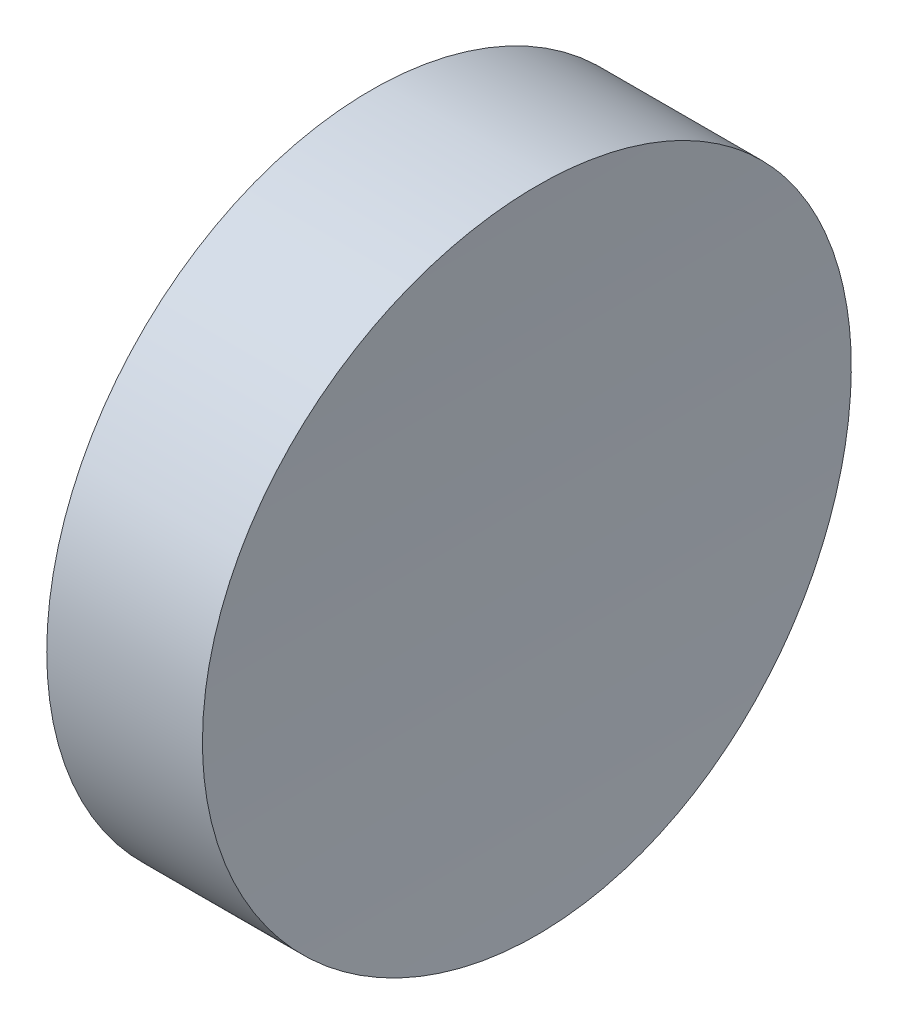
ISO-10303-21;
HEADER;
FILE_DESCRIPTION(('STEP AP214'),'2;1');
FILE_NAME('part.step','',(''),(''),'','','');
FILE_SCHEMA(('AUTOMOTIVE_DESIGN { 1 0 10303 214 1 1 1 1 }'));
ENDSEC;
DATA;
#1=APPLICATION_CONTEXT('core data for automotive mechanical design processes');
#2=APPLICATION_PROTOCOL_DEFINITION('international standard','automotive_design',2000,#1);
#3=PRODUCT_CONTEXT('',#1,'mechanical');
#4=PRODUCT('Part','Part','',(#3));
#5=PRODUCT_RELATED_PRODUCT_CATEGORY('part','',(#4));
#6=PRODUCT_DEFINITION_FORMATION('','',#4);
#7=PRODUCT_DEFINITION_CONTEXT('part definition',#1,'design');
#8=PRODUCT_DEFINITION('design','',#6,#7);
#9=PRODUCT_DEFINITION_SHAPE('','',#8);
#10=(LENGTH_UNIT() NAMED_UNIT(*) SI_UNIT(.MILLI.,.METRE.));
#11=(NAMED_UNIT(*) PLANE_ANGLE_UNIT() SI_UNIT($,.RADIAN.));
#12=(NAMED_UNIT(*) SI_UNIT($,.STERADIAN.) SOLID_ANGLE_UNIT());
#13=UNCERTAINTY_MEASURE_WITH_UNIT(LENGTH_MEASURE(1.E-05),#10,'distance_accuracy_value','');
#14=(GEOMETRIC_REPRESENTATION_CONTEXT(3) GLOBAL_UNCERTAINTY_ASSIGNED_CONTEXT((#13)) GLOBAL_UNIT_ASSIGNED_CONTEXT((#10,
#11,#12)) REPRESENTATION_CONTEXT('',''));
#15=CARTESIAN_POINT('',(0.,0.,0.));
#16=DIRECTION('',(0.,0.,1.));
#17=DIRECTION('',(1.,0.,0.));
#18=AXIS2_PLACEMENT_3D('',#15,#16,#17);
#19=CARTESIAN_POINT('',(10.,0.,0.));
#20=DIRECTION('',(-1.,0.,0.));
#21=DIRECTION('',(0.,0.,1.));
#22=AXIS2_PLACEMENT_3D('',#19,#20,#21);
#23=CYLINDRICAL_SURFACE('',#22,6.25);
#24=CARTESIAN_POINT('',(3.,0.,6.25));
#25=CARTESIAN_POINT('',(2.99999975282153,0.175411695775562,6.25000143414687));
#26=CARTESIAN_POINT('',(3.00046249596297,0.350800526930083,6.24261243693982));
#27=CARTESIAN_POINT('',(3.00230001398185,0.700387534380133,6.21310928672729));
#28=CARTESIAN_POINT('',(3.0036750205354,0.874585396863903,6.19099139320326));
#29=CARTESIAN_POINT('',(3.00730019714173,1.22063933643133,6.13215890796169));
#30=CARTESIAN_POINT('',(3.00955111473763,1.39249328308806,6.09543184750703));
#31=CARTESIAN_POINT('',(3.01486512988574,1.73255098872519,6.00762967850853));
#32=CARTESIAN_POINT('',(3.01792852436811,1.90075338883798,5.95654932396142));
#33=CARTESIAN_POINT('',(3.02477717765007,2.2320975697538,5.84046483123771));
#34=CARTESIAN_POINT('',(3.02856178668783,2.39524375318645,5.77547321964586));
#35=CARTESIAN_POINT('',(3.03674908130322,2.7155371747568,5.63197690343857));
#36=CARTESIAN_POINT('',(3.0411519942849,2.87268217857003,5.55346722464284));
#37=CARTESIAN_POINT('',(3.05044747258813,3.17970547389867,5.38356179219484));
#38=CARTESIAN_POINT('',(3.05533974263971,3.32958806734663,5.2921737956587));
#39=CARTESIAN_POINT('',(3.06547981948221,3.62118365163041,5.09708857059595));
#40=CARTESIAN_POINT('',(3.07072775701874,3.76289360232956,4.99338680479954));
#41=CARTESIAN_POINT('',(3.08143434461132,4.03721456181779,4.77433107889722));
#42=CARTESIAN_POINT('',(3.08689319052866,4.169816779086,4.65896611879228));
#43=CARTESIAN_POINT('',(3.09786434474732,4.42488384228219,4.41743852364674));
#44=CARTESIAN_POINT('',(3.10337667205306,4.54734492530576,4.29127191561924));
#45=CARTESIAN_POINT('',(3.11429475015486,4.78116986424197,4.0291134014546));
#46=CARTESIAN_POINT('',(3.11970053520273,4.89253733486064,3.89312472078814));
#47=CARTESIAN_POINT('',(3.13025608796702,5.10347041631023,3.6121953285557));
#48=CARTESIAN_POINT('',(3.13540576044397,5.20303165558178,3.46725133108256));
#49=CARTESIAN_POINT('',(3.14530285952053,5.38963801087312,3.16941570454395));
#50=CARTESIAN_POINT('',(3.15005010835547,5.47667760735553,3.0165206108207));
#51=CARTESIAN_POINT('',(3.15900645103708,5.6375973489524,2.70387205086162));
#52=CARTESIAN_POINT('',(3.16321534529791,5.71147261758289,2.54411607021835));
#53=CARTESIAN_POINT('',(3.17097117607028,5.84547023298534,2.21897871845918));
#54=CARTESIAN_POINT('',(3.17451836222469,5.90559776830976,2.05359949677873));
#55=CARTESIAN_POINT('',(3.18085362762582,6.01172184056731,1.718335468201));
#56=CARTESIAN_POINT('',(3.18364142658918,6.05771316074529,1.54844902304539));
#57=CARTESIAN_POINT('',(3.19072745555506,6.1737728734606,1.03440869097554));
#58=CARTESIAN_POINT('',(3.19376771631694,6.22225107187843,0.685085319849295));
#59=CARTESIAN_POINT('',(3.19612000985213,6.2598592561564,-0.016563252411651));
#60=CARTESIAN_POINT('',(3.19543208484992,6.24898991417141,-0.368888419503667));
#61=CARTESIAN_POINT('',(3.19041605812459,6.16835192910068,-1.06624990332797));
#62=CARTESIAN_POINT('',(3.18609307139905,6.09866604790453,-1.41129576399771));
#63=CARTESIAN_POINT('',(3.17430045774624,5.90248091136762,-2.08476940449059));
#64=CARTESIAN_POINT('',(3.16683081196514,5.77598131561582,-2.41319708472936));
#65=CARTESIAN_POINT('',(3.14958122762516,5.46967113790213,-3.04439404545759));
#66=CARTESIAN_POINT('',(3.1397996626731,5.28982300339313,-3.34714505821169));
#67=CARTESIAN_POINT('',(3.11903006741817,4.88194672076172,-3.91819049349543));
#68=CARTESIAN_POINT('',(3.10804202355257,4.65391803098673,-4.18648452860036));
#69=CARTESIAN_POINT('',(3.08607506250479,4.15568767254906,-4.68148297816085));
#70=CARTESIAN_POINT('',(3.07509619328168,3.88541435809242,-4.90811528776023));
#71=CARTESIAN_POINT('',(3.05440293175019,3.31061788534803,-5.31280052009997));
#72=CARTESIAN_POINT('',(3.0446885398836,3.00609471509426,-5.49085342586787));
#73=CARTESIAN_POINT('',(3.02761813096755,2.37139913187018,-5.79331955782815));
#74=CARTESIAN_POINT('',(3.02026223399378,2.04122541404212,-5.91773005308958));
#75=CARTESIAN_POINT('',(3.00873933794533,1.3646206924184,-6.10933161213791));
#76=CARTESIAN_POINT('',(3.00457230162862,1.01818987853609,-6.17652334417176));
#77=CARTESIAN_POINT('',(2.99990148672145,0.319530484202308,-6.25169071012972));
#78=CARTESIAN_POINT('',(2.99939154096187,-0.0326873311797192,-6.25976603604084));
#79=CARTESIAN_POINT('',(3.00207596678201,-0.733472537613214,-6.21673183216969));
#80=CARTESIAN_POINT('',(3.00527031908463,-1.08203994765179,-6.16562261038255));
#81=CARTESIAN_POINT('',(3.01499976696369,-1.76534894498554,-6.00575268445015));
#82=CARTESIAN_POINT('',(3.02153221197085,-2.10010127438763,-5.89703771887342));
#83=CARTESIAN_POINT('',(3.03720291990549,-2.74660925587873,-5.62508869233438));
#84=CARTESIAN_POINT('',(3.04634120627014,-3.05836470110001,-5.4618541410159));
#85=CARTESIAN_POINT('',(3.06621215312903,-3.65048587191085,-5.08524613395083));
#86=CARTESIAN_POINT('',(3.0769469238261,-3.93080917765666,-4.87180609700927));
#87=CARTESIAN_POINT('',(3.09879566670794,-4.45168155224733,-4.40094156283031));
#88=CARTESIAN_POINT('',(3.10990964262544,-4.69223022943292,-4.14351663252608));
#89=CARTESIAN_POINT('',(3.13128210046607,-5.12706324137445,-3.59156423267375));
#90=CARTESIAN_POINT('',(3.14153937360663,-5.32128290068955,-3.2969857629855));
#91=CARTESIAN_POINT('',(3.1600221830158,-5.65750042982147,-2.67932719586049));
#92=CARTESIAN_POINT('',(3.16824773181321,-5.79949862166939,-2.35624727419723));
#93=CARTESIAN_POINT('',(3.18173177695383,-6.02713732282975,-1.69105827249094));
#94=CARTESIAN_POINT('',(3.18699241581342,-6.11281853562915,-1.34896313021398));
#95=CARTESIAN_POINT('',(3.19395554311438,-6.22549830363627,-0.655017303226514));
#96=CARTESIAN_POINT('',(3.19565806687023,-6.25249744126667,-0.303166715374417));
#97=CARTESIAN_POINT('',(3.19540905059048,-6.24847457226867,0.223611624143795));
#98=CARTESIAN_POINT('',(3.1948595343774,-6.23972325454669,0.398982264486074));
#99=CARTESIAN_POINT('',(3.19285036603919,-6.20751102323974,0.74834457396785));
#100=CARTESIAN_POINT('',(3.19139105058246,-6.18405555086406,0.922336729102901));
#101=CARTESIAN_POINT('',(3.18760157602614,-6.12258555837999,1.26777391306693));
#102=CARTESIAN_POINT('',(3.18527109532243,-6.08456566146096,1.43921797689568));
#103=CARTESIAN_POINT('',(3.17980719178045,-5.99426013777771,1.77822935286466));
#104=CARTESIAN_POINT('',(3.17667406438502,-5.94197975963661,1.94579806677502));
#105=CARTESIAN_POINT('',(3.16969209192615,-5.82349910897841,2.27599148238164));
#106=CARTESIAN_POINT('',(3.16584299053225,-5.75729385001185,2.43861438906023));
#107=CARTESIAN_POINT('',(3.15754068209407,-5.61147442351194,2.75764464483826));
#108=CARTESIAN_POINT('',(3.15308769748709,-5.53186519066774,2.91405425527402));
#109=CARTESIAN_POINT('',(3.14370112672049,-5.35975756617542,3.21966840932794));
#110=CARTESIAN_POINT('',(3.13876737785678,-5.26725480640588,3.36887048798478));
#111=CARTESIAN_POINT('',(3.12856215788026,-5.07007314723543,3.65890659889868));
#112=CARTESIAN_POINT('',(3.12329081122199,-4.96539872341104,3.79974367840569));
#113=CARTESIAN_POINT('',(3.11254720796232,-4.74436894280843,4.07238513066016));
#114=CARTESIAN_POINT('',(3.10707457644593,-4.62799100709619,4.20417118475326));
#115=CARTESIAN_POINT('',(3.09609541989795,-4.38459577459138,4.45742679175301));
#116=CARTESIAN_POINT('',(3.09058890805737,-4.25758240235755,4.57890011710425));
#117=CARTESIAN_POINT('',(3.07969257558626,-3.99369614606897,4.81079648756327));
#118=CARTESIAN_POINT('',(3.07430282866911,-3.85681725701957,4.92121270299899));
#119=CARTESIAN_POINT('',(3.06379823948622,-3.5742900201125,5.13008794118704));
#120=CARTESIAN_POINT('',(3.05868329654479,-3.42864492583231,5.22855135978317));
#121=CARTESIAN_POINT('',(3.0488631625702,-3.1293286520039,5.4130172572274));
#122=CARTESIAN_POINT('',(3.04415864405656,-2.97564493577776,5.49899943191145));
#123=CARTESIAN_POINT('',(3.03530397028515,-2.66161782510217,5.65766980976284));
#124=CARTESIAN_POINT('',(3.03115361263579,-2.50127689021647,5.73036287000423));
#125=CARTESIAN_POINT('',(3.02352651202665,-2.17515980353222,5.86191645194871));
#126=CARTESIAN_POINT('',(3.02004918983461,-2.00938847026127,5.92078887743383));
#127=CARTESIAN_POINT('',(3.01386315761791,-1.67351648764773,6.02434448593771));
#128=CARTESIAN_POINT('',(3.01115425077921,-1.50341695906987,6.06903130266302));
#129=CARTESIAN_POINT('',(3.00595797766803,-1.11321479834011,6.15412383891529));
#130=CARTESIAN_POINT('',(3.00373209501728,-0.8921162815922,6.19004534928854));
#131=CARTESIAN_POINT('',(3.00075326477628,-0.447332784645195,6.23798249904511));
#132=CARTESIAN_POINT('',(3.00000031514959,-0.223647808022493,6.24999817147995));
#133=CARTESIAN_POINT('',(3.,0.,6.25));
#134=B_SPLINE_CURVE_WITH_KNOTS('',3,(#24,#25,#26,#27,#28,#29,#30,#31,#32,#33,#34,#35,#36,#37,
#38,#39,#40,#41,#42,#43,#44,#45,#46,#47,#48,#49,#50,#51,#52,#53,#54,#55,#56,#57,#58,#59,#60,#61,
#62,#63,#64,#65,#66,#67,#68,#69,#70,#71,#72,#73,#74,#75,#76,#77,#78,#79,#80,#81,#82,#83,#84,#85,
#86,#87,#88,#89,#90,#91,#92,#93,#94,#95,#96,#97,#98,#99,#100,#101,#102,#103,#104,#105,#106,#107,
#108,#109,#110,#111,#112,#113,#114,#115,#116,#117,#118,#119,#120,#121,#122,#123,#124,#125,#126,
#127,#128,#129,#130,#131,#132,#133),.UNSPECIFIED.,.T.,.F.,(4,2,2,2,2,2,2,2,2,2,2,2,2,2,2,2,2,2,
2,2,2,2,2,2,2,2,2,2,2,2,2,2,2,2,2,2,2,2,2,2,2,2,2,2,2,2,2,2,2,2,2,2,2,2,4),(0.,0.52603965100286,
1.05221294486633,1.5788362878035,2.10565235787656,2.63199602988406,3.15853379364436,
3.68475574801318,4.21117220526278,4.73808986131887,5.26520216410453,5.79214214865773,
6.31927664098352,6.84664278674944,7.37420388137049,7.90156553850161,8.42912157741459,
9.48170790312869,10.5342823075472,11.5853780786416,12.6364801476761,13.6883238603988,
14.7401793987257,15.7938386105704,16.8474981905372,17.9012114058998,18.9549123149791,
20.0068358868614,21.0587539845801,22.109838115262,23.1609316997847,24.2134271551543,
25.2659329737895,26.3198996055979,27.3738597378622,28.4270572730441,29.4802443551376,
30.0065016607469,30.5325643419579,31.0588214194236,31.5848850667595,32.1111374172957,
32.6371964493266,33.1634341369182,33.6894789327745,34.2165588104138,34.7434450414378,
35.270654733798,35.7976699446444,36.3255331065461,36.8532029509102,37.3804166292993,
37.9074951503908,38.5781903227744,39.2488845678733),.UNSPECIFIED.);
#135=CARTESIAN_POINT('',(3.,0.,6.25));
#136=VERTEX_POINT('',#135);
#137=EDGE_CURVE('E10',#136,#136,#134,.T.);
#138=ORIENTED_EDGE('',*,*,#137,.T.);
#139=EDGE_LOOP('',(#138));
#140=FACE_BOUND('',#139,.T.);
#141=CARTESIAN_POINT('',(0.,0.,0.));
#142=DIRECTION('',(1.,0.,0.));
#143=DIRECTION('',(0.,0.,-1.));
#144=AXIS2_PLACEMENT_3D('',#141,#142,#143);
#145=CIRCLE('',#144,6.25);
#146=CARTESIAN_POINT('',(0.,0.,-6.25));
#147=VERTEX_POINT('',#146);
#148=EDGE_CURVE('E46',#147,#147,#145,.T.);
#149=ORIENTED_EDGE('',*,*,#148,.T.);
#150=EDGE_LOOP('',(#149));
#151=FACE_BOUND('',#150,.T.);
#152=ADVANCED_FACE('F35',(#140,#151),#23,.T.);
#153=CARTESIAN_POINT('',(0.,0.,0.));
#154=DIRECTION('',(1.,0.,0.));
#155=DIRECTION('',(0.,0.,-1.));
#156=AXIS2_PLACEMENT_3D('',#153,#154,#155);
#157=PLANE('',#156);
#158=ORIENTED_EDGE('',*,*,#148,.F.);
#159=EDGE_LOOP('',(#158));
#160=FACE_BOUND('',#159,.T.);
#161=ADVANCED_FACE('F53',(#160),#157,.F.);
#162=CARTESIAN_POINT('',(103.,0.,-6.25));
#163=DIRECTION('',(0.,0.,1.));
#164=DIRECTION('',(1.,0.,0.));
#165=AXIS2_PLACEMENT_3D('',#162,#163,#164);
#166=CYLINDRICAL_SURFACE('',#165,100.);
#167=ORIENTED_EDGE('',*,*,#137,.F.);
#168=EDGE_LOOP('',(#167));
#169=FACE_BOUND('',#168,.T.);
#170=ADVANCED_FACE('F55',(#169),#166,.F.);
#171=CLOSED_SHELL('',(#152,#161,#170));
#172=MANIFOLD_SOLID_BREP('B2',#171);
#173=ADVANCED_BREP_SHAPE_REPRESENTATION('',(#18,#172),#14);
#174=SHAPE_DEFINITION_REPRESENTATION(#9,#173);
ENDSEC;
END-ISO-10303-21;
